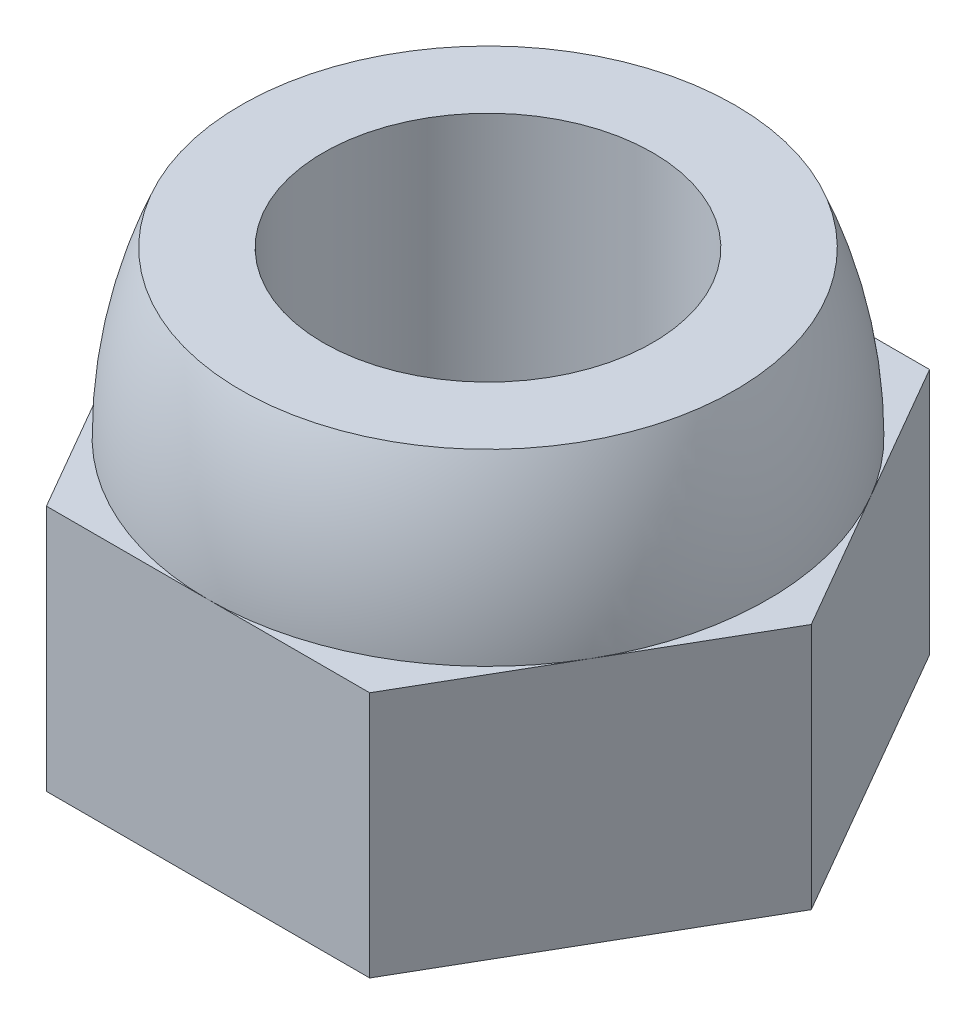
ISO-10303-21;
HEADER;
FILE_DESCRIPTION(('STEP AP214'),'2;1');
FILE_NAME('part.step','',(''),(''),'','','');
FILE_SCHEMA(('AUTOMOTIVE_DESIGN { 1 0 10303 214 1 1 1 1 }'));
ENDSEC;
DATA;
#1=APPLICATION_CONTEXT('core data for automotive mechanical design processes');
#2=APPLICATION_PROTOCOL_DEFINITION('international standard','automotive_design',2000,#1);
#3=PRODUCT_CONTEXT('',#1,'mechanical');
#4=PRODUCT('Part','Part','',(#3));
#5=PRODUCT_RELATED_PRODUCT_CATEGORY('part','',(#4));
#6=PRODUCT_DEFINITION_FORMATION('','',#4);
#7=PRODUCT_DEFINITION_CONTEXT('part definition',#1,'design');
#8=PRODUCT_DEFINITION('design','',#6,#7);
#9=PRODUCT_DEFINITION_SHAPE('','',#8);
#10=(LENGTH_UNIT() NAMED_UNIT(*) SI_UNIT(.MILLI.,.METRE.));
#11=(NAMED_UNIT(*) PLANE_ANGLE_UNIT() SI_UNIT($,.RADIAN.));
#12=(NAMED_UNIT(*) SI_UNIT($,.STERADIAN.) SOLID_ANGLE_UNIT());
#13=UNCERTAINTY_MEASURE_WITH_UNIT(LENGTH_MEASURE(1.E-05),#10,'distance_accuracy_value','');
#14=(GEOMETRIC_REPRESENTATION_CONTEXT(3) GLOBAL_UNCERTAINTY_ASSIGNED_CONTEXT((#13)) GLOBAL_UNIT_ASSIGNED_CONTEXT((#10,
#11,#12)) REPRESENTATION_CONTEXT('',''));
#15=CARTESIAN_POINT('',(0.,0.,0.));
#16=DIRECTION('',(0.,0.,1.));
#17=DIRECTION('',(1.,0.,0.));
#18=AXIS2_PLACEMENT_3D('',#15,#16,#17);
#19=CARTESIAN_POINT('',(0.,3.,0.));
#20=DIRECTION('',(0.,1.,0.));
#21=DIRECTION('',(0.,0.,1.));
#22=AXIS2_PLACEMENT_3D('',#19,#20,#21);
#23=PLANE('',#22);
#24=DIRECTION('',(-1.,0.,0.));
#25=VECTOR('',#24,1.);
#26=CARTESIAN_POINT('',(1.96299091524473,3.,-3.4));
#27=LINE('',#26,#25);
#28=CARTESIAN_POINT('',(1.96299091524473,3.,-3.4));
#29=VERTEX_POINT('',#28);
#30=CARTESIAN_POINT('',(0.,3.,-3.4));
#31=VERTEX_POINT('',#30);
#32=EDGE_CURVE('E112',#29,#31,#27,.T.);
#33=ORIENTED_EDGE('',*,*,#32,.T.);
#34=CARTESIAN_POINT('',(0.,3.,0.));
#35=DIRECTION('',(0.,-1.,0.));
#36=DIRECTION('',(0.,0.,-1.));
#37=AXIS2_PLACEMENT_3D('',#34,#35,#36);
#38=CIRCLE('',#37,3.4);
#39=CARTESIAN_POINT('',(2.94448637286709,3.,-1.7));
#40=VERTEX_POINT('',#39);
#41=EDGE_CURVE('E44',#31,#40,#38,.T.);
#42=ORIENTED_EDGE('',*,*,#41,.T.);
#43=DIRECTION('',(-0.5,0.,-0.866025403784439));
#44=VECTOR('',#43,1.);
#45=CARTESIAN_POINT('',(3.92598183048946,3.,0.));
#46=LINE('',#45,#44);
#47=EDGE_CURVE('E109',#40,#29,#46,.T.);
#48=ORIENTED_EDGE('',*,*,#47,.T.);
#49=EDGE_LOOP('',(#33,#42,#48));
#50=FACE_BOUND('',#49,.T.);
#51=ADVANCED_FACE('F33',(#50),#23,.T.);
#52=CARTESIAN_POINT('',(3.92598183048946,3.,0.));
#53=VERTEX_POINT('',#52);
#54=EDGE_CURVE('E117',#53,#40,#46,.T.);
#55=ORIENTED_EDGE('',*,*,#54,.T.);
#56=CARTESIAN_POINT('',(2.94448637286709,3.,1.7));
#57=VERTEX_POINT('',#56);
#58=EDGE_CURVE('E11',#40,#57,#38,.T.);
#59=ORIENTED_EDGE('',*,*,#58,.T.);
#60=DIRECTION('',(0.5,0.,-0.866025403784439));
#61=VECTOR('',#60,1.);
#62=CARTESIAN_POINT('',(1.96299091524473,3.,3.4));
#63=LINE('',#62,#61);
#64=EDGE_CURVE('E222',#57,#53,#63,.T.);
#65=ORIENTED_EDGE('',*,*,#64,.T.);
#66=EDGE_LOOP('',(#55,#59,#65));
#67=FACE_BOUND('',#66,.T.);
#68=ADVANCED_FACE('F192',(#67),#23,.T.);
#69=CARTESIAN_POINT('',(1.96299091524473,3.,3.4));
#70=VERTEX_POINT('',#69);
#71=EDGE_CURVE('E118',#70,#57,#63,.T.);
#72=ORIENTED_EDGE('',*,*,#71,.T.);
#73=CARTESIAN_POINT('',(0.,3.,3.4));
#74=VERTEX_POINT('',#73);
#75=EDGE_CURVE('E42',#57,#74,#38,.T.);
#76=ORIENTED_EDGE('',*,*,#75,.T.);
#77=DIRECTION('',(1.,0.,0.));
#78=VECTOR('',#77,1.);
#79=CARTESIAN_POINT('',(-1.96299091524473,3.,3.4));
#80=LINE('',#79,#78);
#81=EDGE_CURVE('E218',#74,#70,#80,.T.);
#82=ORIENTED_EDGE('',*,*,#81,.T.);
#83=EDGE_LOOP('',(#72,#76,#82));
#84=FACE_BOUND('',#83,.T.);
#85=ADVANCED_FACE('F198',(#84),#23,.T.);
#86=CARTESIAN_POINT('',(-1.96299091524473,3.,3.4));
#87=VERTEX_POINT('',#86);
#88=EDGE_CURVE('E220',#87,#74,#80,.T.);
#89=ORIENTED_EDGE('',*,*,#88,.T.);
#90=CARTESIAN_POINT('',(-2.94448637286709,3.,1.7));
#91=VERTEX_POINT('',#90);
#92=EDGE_CURVE('E168',#74,#91,#38,.T.);
#93=ORIENTED_EDGE('',*,*,#92,.T.);
#94=DIRECTION('',(0.5,0.,0.866025403784439));
#95=VECTOR('',#94,1.);
#96=CARTESIAN_POINT('',(-3.92598183048946,3.,0.));
#97=LINE('',#96,#95);
#98=EDGE_CURVE('E96',#91,#87,#97,.T.);
#99=ORIENTED_EDGE('',*,*,#98,.T.);
#100=EDGE_LOOP('',(#89,#93,#99));
#101=FACE_BOUND('',#100,.T.);
#102=ADVANCED_FACE('F210',(#101),#23,.T.);
#103=CARTESIAN_POINT('',(-3.92598183048946,3.,0.));
#104=VERTEX_POINT('',#103);
#105=EDGE_CURVE('E217',#104,#91,#97,.T.);
#106=ORIENTED_EDGE('',*,*,#105,.T.);
#107=CARTESIAN_POINT('',(-2.94448637286709,3.,-1.7));
#108=VERTEX_POINT('',#107);
#109=EDGE_CURVE('E166',#91,#108,#38,.T.);
#110=ORIENTED_EDGE('',*,*,#109,.T.);
#111=DIRECTION('',(-0.5,0.,0.866025403784439));
#112=VECTOR('',#111,1.);
#113=CARTESIAN_POINT('',(-1.96299091524473,3.,-3.4));
#114=LINE('',#113,#112);
#115=EDGE_CURVE('E59',#108,#104,#114,.T.);
#116=ORIENTED_EDGE('',*,*,#115,.T.);
#117=EDGE_LOOP('',(#106,#110,#116));
#118=FACE_BOUND('',#117,.T.);
#119=ADVANCED_FACE('F204',(#118),#23,.T.);
#120=CARTESIAN_POINT('',(-1.96299091524473,3.,-3.4));
#121=VERTEX_POINT('',#120);
#122=EDGE_CURVE('E136',#121,#108,#114,.T.);
#123=ORIENTED_EDGE('',*,*,#122,.T.);
#124=EDGE_CURVE('E163',#108,#31,#38,.T.);
#125=ORIENTED_EDGE('',*,*,#124,.T.);
#126=EDGE_CURVE('E134',#31,#121,#27,.T.);
#127=ORIENTED_EDGE('',*,*,#126,.T.);
#128=EDGE_LOOP('',(#123,#125,#127));
#129=FACE_BOUND('',#128,.T.);
#130=ADVANCED_FACE('F194',(#129),#23,.T.);
#131=CARTESIAN_POINT('',(0.,0.,0.));
#132=DIRECTION('',(0.,1.,0.));
#133=DIRECTION('',(0.,0.,1.));
#134=AXIS2_PLACEMENT_3D('',#131,#132,#133);
#135=PLANE('',#134);
#136=DIRECTION('',(0.5,0.,0.866025403784439));
#137=VECTOR('',#136,1.);
#138=CARTESIAN_POINT('',(-3.92598183048946,0.,0.));
#139=LINE('',#138,#137);
#140=CARTESIAN_POINT('',(-3.92598183048946,0.,0.));
#141=VERTEX_POINT('',#140);
#142=CARTESIAN_POINT('',(-1.96299091524473,0.,3.4));
#143=VERTEX_POINT('',#142);
#144=EDGE_CURVE('E142',#141,#143,#139,.T.);
#145=ORIENTED_EDGE('',*,*,#144,.F.);
#146=DIRECTION('',(-0.5,0.,0.866025403784439));
#147=VECTOR('',#146,1.);
#148=CARTESIAN_POINT('',(-1.96299091524473,0.,-3.4));
#149=LINE('',#148,#147);
#150=CARTESIAN_POINT('',(-1.96299091524473,0.,-3.4));
#151=VERTEX_POINT('',#150);
#152=EDGE_CURVE('E87',#151,#141,#149,.T.);
#153=ORIENTED_EDGE('',*,*,#152,.F.);
#154=DIRECTION('',(-1.,0.,0.));
#155=VECTOR('',#154,1.);
#156=CARTESIAN_POINT('',(1.96299091524473,0.,-3.4));
#157=LINE('',#156,#155);
#158=CARTESIAN_POINT('',(1.96299091524473,0.,-3.4));
#159=VERTEX_POINT('',#158);
#160=EDGE_CURVE('E151',#159,#151,#157,.T.);
#161=ORIENTED_EDGE('',*,*,#160,.F.);
#162=DIRECTION('',(-0.5,0.,-0.866025403784439));
#163=VECTOR('',#162,1.);
#164=CARTESIAN_POINT('',(3.92598183048946,0.,0.));
#165=LINE('',#164,#163);
#166=CARTESIAN_POINT('',(3.92598183048946,0.,0.));
#167=VERTEX_POINT('',#166);
#168=EDGE_CURVE('E125',#167,#159,#165,.T.);
#169=ORIENTED_EDGE('',*,*,#168,.F.);
#170=DIRECTION('',(0.5,0.,-0.866025403784439));
#171=VECTOR('',#170,1.);
#172=CARTESIAN_POINT('',(1.96299091524473,0.,3.4));
#173=LINE('',#172,#171);
#174=CARTESIAN_POINT('',(1.96299091524473,0.,3.4));
#175=VERTEX_POINT('',#174);
#176=EDGE_CURVE('E148',#175,#167,#173,.T.);
#177=ORIENTED_EDGE('',*,*,#176,.F.);
#178=DIRECTION('',(1.,0.,0.));
#179=VECTOR('',#178,1.);
#180=CARTESIAN_POINT('',(-1.96299091524473,0.,3.4));
#181=LINE('',#180,#179);
#182=EDGE_CURVE('E145',#143,#175,#181,.T.);
#183=ORIENTED_EDGE('',*,*,#182,.F.);
#184=EDGE_LOOP('',(#145,#153,#161,#169,#177,#183));
#185=FACE_BOUND('',#184,.T.);
#186=CARTESIAN_POINT('',(0.,0.,0.));
#187=DIRECTION('',(0.,1.,0.));
#188=DIRECTION('',(0.,0.,1.));
#189=AXIS2_PLACEMENT_3D('',#186,#187,#188);
#190=CIRCLE('',#189,2.);
#191=CARTESIAN_POINT('',(0.,0.,2.));
#192=VERTEX_POINT('',#191);
#193=EDGE_CURVE('E146',#192,#192,#190,.T.);
#194=ORIENTED_EDGE('',*,*,#193,.T.);
#195=EDGE_LOOP('',(#194));
#196=FACE_BOUND('',#195,.T.);
#197=ADVANCED_FACE('F203',(#185,#196),#135,.F.);
#198=CARTESIAN_POINT('',(-3.92598183048946,3.,0.));
#199=DIRECTION('',(0.866025403784439,0.,-0.5));
#200=DIRECTION('',(-0.5,0.,-0.866025403784439));
#201=AXIS2_PLACEMENT_3D('',#198,#199,#200);
#202=PLANE('',#201);
#203=ORIENTED_EDGE('',*,*,#144,.T.);
#204=DIRECTION('',(0.,-1.,0.));
#205=VECTOR('',#204,1.);
#206=CARTESIAN_POINT('',(-1.96299091524473,3.,3.4));
#207=LINE('',#206,#205);
#208=EDGE_CURVE('E37',#87,#143,#207,.T.);
#209=ORIENTED_EDGE('',*,*,#208,.F.);
#210=ORIENTED_EDGE('',*,*,#98,.F.);
#211=ORIENTED_EDGE('',*,*,#105,.F.);
#212=DIRECTION('',(0.,-1.,0.));
#213=VECTOR('',#212,1.);
#214=CARTESIAN_POINT('',(-3.92598183048946,3.,0.));
#215=LINE('',#214,#213);
#216=EDGE_CURVE('E141',#104,#141,#215,.T.);
#217=ORIENTED_EDGE('',*,*,#216,.T.);
#218=EDGE_LOOP('',(#203,#209,#210,#211,#217));
#219=FACE_BOUND('',#218,.T.);
#220=ADVANCED_FACE('F35',(#219),#202,.F.);
#221=CARTESIAN_POINT('',(-1.96299091524473,3.,3.4));
#222=DIRECTION('',(0.,0.,-1.));
#223=DIRECTION('',(-1.,0.,0.));
#224=AXIS2_PLACEMENT_3D('',#221,#222,#223);
#225=PLANE('',#224);
#226=ORIENTED_EDGE('',*,*,#182,.T.);
#227=DIRECTION('',(0.,-1.,0.));
#228=VECTOR('',#227,1.);
#229=CARTESIAN_POINT('',(1.96299091524473,3.,3.4));
#230=LINE('',#229,#228);
#231=EDGE_CURVE('E156',#70,#175,#230,.T.);
#232=ORIENTED_EDGE('',*,*,#231,.F.);
#233=ORIENTED_EDGE('',*,*,#81,.F.);
#234=ORIENTED_EDGE('',*,*,#88,.F.);
#235=ORIENTED_EDGE('',*,*,#208,.T.);
#236=EDGE_LOOP('',(#226,#232,#233,#234,#235));
#237=FACE_BOUND('',#236,.T.);
#238=ADVANCED_FACE('F231',(#237),#225,.F.);
#239=CARTESIAN_POINT('',(1.96299091524473,3.,3.4));
#240=DIRECTION('',(-0.866025403784439,0.,-0.5));
#241=DIRECTION('',(-0.5,0.,0.866025403784439));
#242=AXIS2_PLACEMENT_3D('',#239,#240,#241);
#243=PLANE('',#242);
#244=ORIENTED_EDGE('',*,*,#176,.T.);
#245=DIRECTION('',(0.,-1.,0.));
#246=VECTOR('',#245,1.);
#247=CARTESIAN_POINT('',(3.92598183048946,3.,0.));
#248=LINE('',#247,#246);
#249=EDGE_CURVE('E128',#53,#167,#248,.T.);
#250=ORIENTED_EDGE('',*,*,#249,.F.);
#251=ORIENTED_EDGE('',*,*,#64,.F.);
#252=ORIENTED_EDGE('',*,*,#71,.F.);
#253=ORIENTED_EDGE('',*,*,#231,.T.);
#254=EDGE_LOOP('',(#244,#250,#251,#252,#253));
#255=FACE_BOUND('',#254,.T.);
#256=ADVANCED_FACE('F229',(#255),#243,.F.);
#257=CARTESIAN_POINT('',(3.92598183048946,3.,0.));
#258=DIRECTION('',(-0.866025403784439,0.,0.5));
#259=DIRECTION('',(0.5,0.,0.866025403784439));
#260=AXIS2_PLACEMENT_3D('',#257,#258,#259);
#261=PLANE('',#260);
#262=ORIENTED_EDGE('',*,*,#168,.T.);
#263=DIRECTION('',(0.,-1.,0.));
#264=VECTOR('',#263,1.);
#265=CARTESIAN_POINT('',(1.96299091524473,3.,-3.4));
#266=LINE('',#265,#264);
#267=EDGE_CURVE('E121',#29,#159,#266,.T.);
#268=ORIENTED_EDGE('',*,*,#267,.F.);
#269=ORIENTED_EDGE('',*,*,#47,.F.);
#270=ORIENTED_EDGE('',*,*,#54,.F.);
#271=ORIENTED_EDGE('',*,*,#249,.T.);
#272=EDGE_LOOP('',(#262,#268,#269,#270,#271));
#273=FACE_BOUND('',#272,.T.);
#274=ADVANCED_FACE('F122',(#273),#261,.F.);
#275=CARTESIAN_POINT('',(1.96299091524473,3.,-3.4));
#276=DIRECTION('',(0.,0.,1.));
#277=DIRECTION('',(1.,0.,0.));
#278=AXIS2_PLACEMENT_3D('',#275,#276,#277);
#279=PLANE('',#278);
#280=ORIENTED_EDGE('',*,*,#160,.T.);
#281=DIRECTION('',(0.,-1.,0.));
#282=VECTOR('',#281,1.);
#283=CARTESIAN_POINT('',(-1.96299091524473,3.,-3.4));
#284=LINE('',#283,#282);
#285=EDGE_CURVE('E129',#121,#151,#284,.T.);
#286=ORIENTED_EDGE('',*,*,#285,.F.);
#287=ORIENTED_EDGE('',*,*,#126,.F.);
#288=ORIENTED_EDGE('',*,*,#32,.F.);
#289=ORIENTED_EDGE('',*,*,#267,.T.);
#290=EDGE_LOOP('',(#280,#286,#287,#288,#289));
#291=FACE_BOUND('',#290,.T.);
#292=ADVANCED_FACE('F132',(#291),#279,.F.);
#293=CARTESIAN_POINT('',(-1.96299091524473,3.,-3.4));
#294=DIRECTION('',(0.866025403784439,0.,0.5));
#295=DIRECTION('',(0.5,0.,-0.866025403784439));
#296=AXIS2_PLACEMENT_3D('',#293,#294,#295);
#297=PLANE('',#296);
#298=ORIENTED_EDGE('',*,*,#152,.T.);
#299=ORIENTED_EDGE('',*,*,#216,.F.);
#300=ORIENTED_EDGE('',*,*,#115,.F.);
#301=ORIENTED_EDGE('',*,*,#122,.F.);
#302=ORIENTED_EDGE('',*,*,#285,.T.);
#303=EDGE_LOOP('',(#298,#299,#300,#301,#302));
#304=FACE_BOUND('',#303,.T.);
#305=ADVANCED_FACE('F213',(#304),#297,.F.);
#306=CARTESIAN_POINT('',(0.,3.,0.));
#307=DIRECTION('',(0.,-1.,0.));
#308=DIRECTION('',(0.,0.,-1.));
#309=AXIS2_PLACEMENT_3D('',#306,#307,#308);
#310=CYLINDRICAL_SURFACE('',#309,2.);
#311=ORIENTED_EDGE('',*,*,#193,.F.);
#312=EDGE_LOOP('',(#311));
#313=FACE_BOUND('',#312,.T.);
#314=CARTESIAN_POINT('',(0.,5.,0.));
#315=DIRECTION('',(0.,-1.,0.));
#316=DIRECTION('',(0.,0.,-1.));
#317=AXIS2_PLACEMENT_3D('',#314,#315,#316);
#318=CIRCLE('',#317,2.);
#319=CARTESIAN_POINT('',(0.,5.,-2.));
#320=VERTEX_POINT('',#319);
#321=EDGE_CURVE('E171',#320,#320,#318,.T.);
#322=ORIENTED_EDGE('',*,*,#321,.F.);
#323=EDGE_LOOP('',(#322));
#324=FACE_BOUND('',#323,.T.);
#325=ADVANCED_FACE('F189',(#313,#324),#310,.F.);
#326=CARTESIAN_POINT('',(0.,3.,0.));
#327=DIRECTION('',(0.,-1.,0.));
#328=DIRECTION('',(0.,0.,-1.));
#329=AXIS2_PLACEMENT_3D('',#326,#327,#328);
#330=DEGENERATE_TOROIDAL_SURFACE('',#329,1.79999999999997,5.19999999999997,.F.);
#331=ORIENTED_EDGE('',*,*,#41,.F.);
#332=ORIENTED_EDGE('',*,*,#124,.F.);
#333=ORIENTED_EDGE('',*,*,#109,.F.);
#334=ORIENTED_EDGE('',*,*,#92,.F.);
#335=ORIENTED_EDGE('',*,*,#75,.F.);
#336=ORIENTED_EDGE('',*,*,#58,.F.);
#337=EDGE_LOOP('',(#331,#332,#333,#334,#335,#336));
#338=FACE_BOUND('',#337,.T.);
#339=CARTESIAN_POINT('',(0.,5.,0.));
#340=DIRECTION('',(0.,-1.,0.));
#341=DIRECTION('',(0.,0.,-1.));
#342=AXIS2_PLACEMENT_3D('',#339,#340,#341);
#343=CIRCLE('',#342,3.);
#344=CARTESIAN_POINT('',(0.,5.,-3.));
#345=VERTEX_POINT('',#344);
#346=EDGE_CURVE('E174',#345,#345,#343,.T.);
#347=ORIENTED_EDGE('',*,*,#346,.T.);
#348=EDGE_LOOP('',(#347));
#349=FACE_BOUND('',#348,.T.);
#350=ADVANCED_FACE('F181',(#338,#349),#330,.F.);
#351=CARTESIAN_POINT('',(0.,5.,2.));
#352=DIRECTION('',(0.,-1.,0.));
#353=DIRECTION('',(0.,0.,-1.));
#354=AXIS2_PLACEMENT_3D('',#351,#352,#353);
#355=PLANE('',#354);
#356=ORIENTED_EDGE('',*,*,#346,.F.);
#357=EDGE_LOOP('',(#356));
#358=FACE_BOUND('',#357,.T.);
#359=ORIENTED_EDGE('',*,*,#321,.T.);
#360=EDGE_LOOP('',(#359));
#361=FACE_BOUND('',#360,.T.);
#362=ADVANCED_FACE('F183',(#358,#361),#355,.F.);
#363=CLOSED_SHELL('',(#51,#68,#85,#102,#119,#130,#197,#220,#238,#256,#274,#292,#305,#325,#350,#362));
#364=MANIFOLD_SOLID_BREP('B2',#363);
#365=ADVANCED_BREP_SHAPE_REPRESENTATION('',(#18,#364),#14);
#366=SHAPE_DEFINITION_REPRESENTATION(#9,#365);
ENDSEC;
END-ISO-10303-21;
